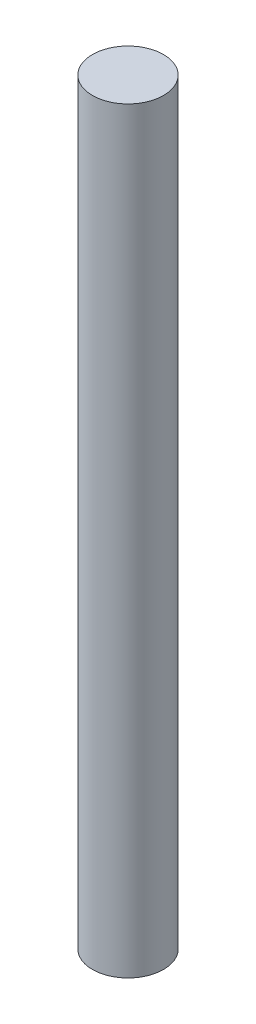
ISO-10303-21;
HEADER;
FILE_DESCRIPTION(('STEP AP214'),'2;1');
FILE_NAME('part.step','',(''),(''),'','','');
FILE_SCHEMA(('AUTOMOTIVE_DESIGN { 1 0 10303 214 1 1 1 1 }'));
ENDSEC;
DATA;
#1=APPLICATION_CONTEXT('core data for automotive mechanical design processes');
#2=APPLICATION_PROTOCOL_DEFINITION('international standard','automotive_design',2000,#1);
#3=PRODUCT_CONTEXT('',#1,'mechanical');
#4=PRODUCT('Part','Part','',(#3));
#5=PRODUCT_RELATED_PRODUCT_CATEGORY('part','',(#4));
#6=PRODUCT_DEFINITION_FORMATION('','',#4);
#7=PRODUCT_DEFINITION_CONTEXT('part definition',#1,'design');
#8=PRODUCT_DEFINITION('design','',#6,#7);
#9=PRODUCT_DEFINITION_SHAPE('','',#8);
#10=(LENGTH_UNIT() NAMED_UNIT(*) SI_UNIT(.MILLI.,.METRE.));
#11=(NAMED_UNIT(*) PLANE_ANGLE_UNIT() SI_UNIT($,.RADIAN.));
#12=(NAMED_UNIT(*) SI_UNIT($,.STERADIAN.) SOLID_ANGLE_UNIT());
#13=UNCERTAINTY_MEASURE_WITH_UNIT(LENGTH_MEASURE(1.E-05),#10,'distance_accuracy_value','');
#14=(GEOMETRIC_REPRESENTATION_CONTEXT(3) GLOBAL_UNCERTAINTY_ASSIGNED_CONTEXT((#13)) GLOBAL_UNIT_ASSIGNED_CONTEXT((#10,
#11,#12)) REPRESENTATION_CONTEXT('',''));
#15=CARTESIAN_POINT('',(0.,0.,0.));
#16=DIRECTION('',(0.,0.,1.));
#17=DIRECTION('',(1.,0.,0.));
#18=AXIS2_PLACEMENT_3D('',#15,#16,#17);
#19=CARTESIAN_POINT('',(0.,95.,0.));
#20=DIRECTION('',(0.,-1.,0.));
#21=DIRECTION('',(0.,0.,-1.));
#22=AXIS2_PLACEMENT_3D('',#19,#20,#21);
#23=CYLINDRICAL_SURFACE('',#22,4.);
#24=CARTESIAN_POINT('',(0.,0.,0.));
#25=DIRECTION('',(0.,1.,0.));
#26=DIRECTION('',(0.,0.,1.));
#27=AXIS2_PLACEMENT_3D('',#24,#25,#26);
#28=CIRCLE('',#27,4.);
#29=CARTESIAN_POINT('',(0.,0.,4.));
#30=VERTEX_POINT('',#29);
#31=EDGE_CURVE('E10',#30,#30,#28,.T.);
#32=ORIENTED_EDGE('',*,*,#31,.T.);
#33=EDGE_LOOP('',(#32));
#34=FACE_BOUND('',#33,.T.);
#35=CARTESIAN_POINT('',(0.,85.26,0.));
#36=DIRECTION('',(0.,1.,0.));
#37=DIRECTION('',(0.,0.,1.));
#38=AXIS2_PLACEMENT_3D('',#35,#36,#37);
#39=CIRCLE('',#38,4.);
#40=CARTESIAN_POINT('',(0.,85.26,4.));
#41=VERTEX_POINT('',#40);
#42=EDGE_CURVE('E49',#41,#41,#39,.T.);
#43=ORIENTED_EDGE('',*,*,#42,.F.);
#44=EDGE_LOOP('',(#43));
#45=FACE_BOUND('',#44,.T.);
#46=ADVANCED_FACE('F43',(#34,#45),#23,.T.);
#47=CARTESIAN_POINT('',(0.,0.,0.));
#48=DIRECTION('',(0.,1.,0.));
#49=DIRECTION('',(0.,0.,1.));
#50=AXIS2_PLACEMENT_3D('',#47,#48,#49);
#51=PLANE('',#50);
#52=ORIENTED_EDGE('',*,*,#31,.F.);
#53=EDGE_LOOP('',(#52));
#54=FACE_BOUND('',#53,.T.);
#55=ADVANCED_FACE('F58',(#54),#51,.F.);
#56=CARTESIAN_POINT('',(0.,85.26,0.));
#57=DIRECTION('',(0.,1.,0.));
#58=DIRECTION('',(0.,0.,1.));
#59=AXIS2_PLACEMENT_3D('',#56,#57,#58);
#60=PLANE('',#59);
#61=ORIENTED_EDGE('',*,*,#42,.T.);
#62=EDGE_LOOP('',(#61));
#63=FACE_BOUND('',#62,.T.);
#64=ADVANCED_FACE('F55',(#63),#60,.T.);
#65=CLOSED_SHELL('',(#46,#55,#64));
#66=MANIFOLD_SOLID_BREP('B2',#65);
#67=ADVANCED_BREP_SHAPE_REPRESENTATION('',(#18,#66),#14);
#68=SHAPE_DEFINITION_REPRESENTATION(#9,#67);
ENDSEC;
END-ISO-10303-21;
